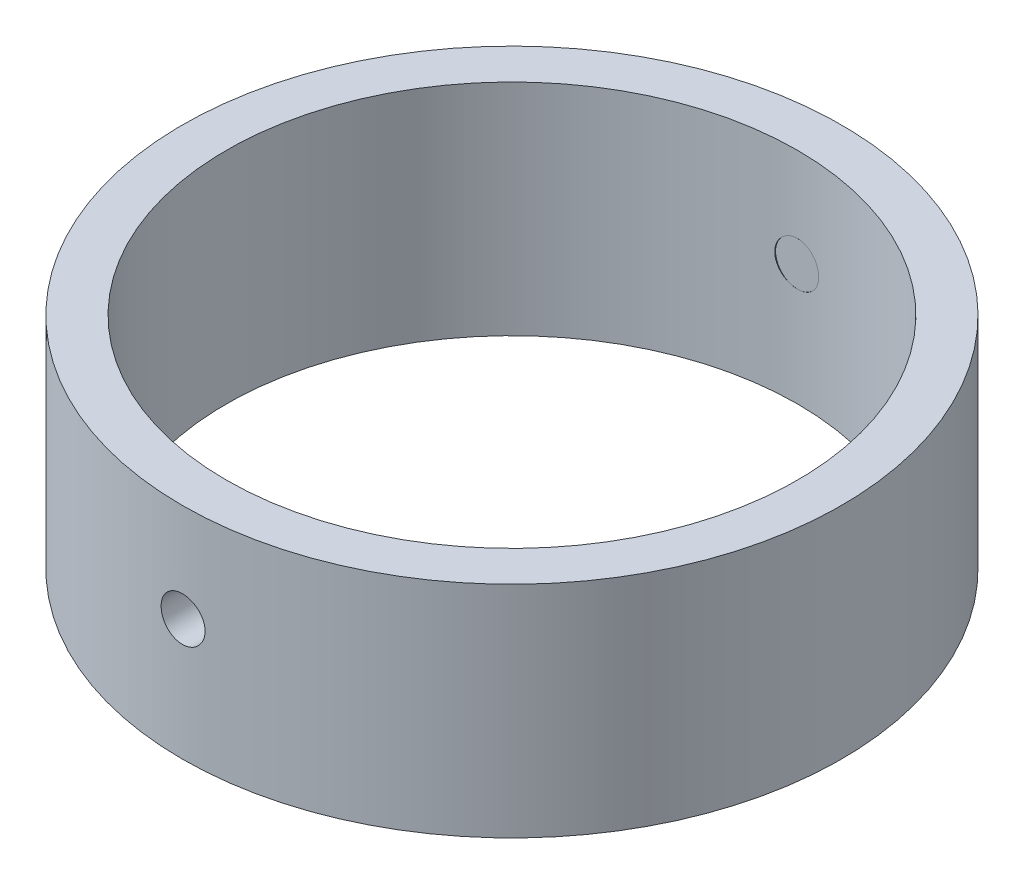
ISO-10303-21;
HEADER;
FILE_DESCRIPTION(('STEP AP214'),'2;1');
FILE_NAME('part.step','',(''),(''),'','','');
FILE_SCHEMA(('AUTOMOTIVE_DESIGN { 1 0 10303 214 1 1 1 1 }'));
ENDSEC;
DATA;
#1=APPLICATION_CONTEXT('core data for automotive mechanical design processes');
#2=APPLICATION_PROTOCOL_DEFINITION('international standard','automotive_design',2000,#1);
#3=PRODUCT_CONTEXT('',#1,'mechanical');
#4=PRODUCT('Part','Part','',(#3));
#5=PRODUCT_RELATED_PRODUCT_CATEGORY('part','',(#4));
#6=PRODUCT_DEFINITION_FORMATION('','',#4);
#7=PRODUCT_DEFINITION_CONTEXT('part definition',#1,'design');
#8=PRODUCT_DEFINITION('design','',#6,#7);
#9=PRODUCT_DEFINITION_SHAPE('','',#8);
#10=(LENGTH_UNIT() NAMED_UNIT(*) SI_UNIT(.MILLI.,.METRE.));
#11=(NAMED_UNIT(*) PLANE_ANGLE_UNIT() SI_UNIT($,.RADIAN.));
#12=(NAMED_UNIT(*) SI_UNIT($,.STERADIAN.) SOLID_ANGLE_UNIT());
#13=UNCERTAINTY_MEASURE_WITH_UNIT(LENGTH_MEASURE(1.E-05),#10,'distance_accuracy_value','');
#14=(GEOMETRIC_REPRESENTATION_CONTEXT(3) GLOBAL_UNCERTAINTY_ASSIGNED_CONTEXT((#13)) GLOBAL_UNIT_ASSIGNED_CONTEXT((#10,
#11,#12)) REPRESENTATION_CONTEXT('',''));
#15=CARTESIAN_POINT('',(0.,0.,0.));
#16=DIRECTION('',(0.,0.,1.));
#17=DIRECTION('',(1.,0.,0.));
#18=AXIS2_PLACEMENT_3D('',#15,#16,#17);
#19=CARTESIAN_POINT('',(0.,10.,0.));
#20=DIRECTION('',(0.,1.,0.));
#21=DIRECTION('',(0.,0.,1.));
#22=AXIS2_PLACEMENT_3D('',#19,#20,#21);
#23=PLANE('',#22);
#24=CARTESIAN_POINT('',(0.,10.,0.));
#25=DIRECTION('',(0.,1.,0.));
#26=DIRECTION('',(0.,0.,1.));
#27=AXIS2_PLACEMENT_3D('',#24,#25,#26);
#28=CIRCLE('',#27,15.);
#29=CARTESIAN_POINT('',(0.,10.,15.));
#30=VERTEX_POINT('',#29);
#31=EDGE_CURVE('E62',#30,#30,#28,.T.);
#32=ORIENTED_EDGE('',*,*,#31,.T.);
#33=EDGE_LOOP('',(#32));
#34=FACE_BOUND('',#33,.T.);
#35=CARTESIAN_POINT('',(0.,10.,0.));
#36=DIRECTION('',(0.,1.,0.));
#37=DIRECTION('',(0.,0.,1.));
#38=AXIS2_PLACEMENT_3D('',#35,#36,#37);
#39=CIRCLE('',#38,13.);
#40=CARTESIAN_POINT('',(0.,10.,13.));
#41=VERTEX_POINT('',#40);
#42=EDGE_CURVE('E77',#41,#41,#39,.T.);
#43=ORIENTED_EDGE('',*,*,#42,.F.);
#44=EDGE_LOOP('',(#43));
#45=FACE_BOUND('',#44,.T.);
#46=ADVANCED_FACE('F35',(#34,#45),#23,.T.);
#47=CARTESIAN_POINT('',(0.,0.,0.));
#48=DIRECTION('',(0.,1.,0.));
#49=DIRECTION('',(0.,0.,1.));
#50=AXIS2_PLACEMENT_3D('',#47,#48,#49);
#51=PLANE('',#50);
#52=CARTESIAN_POINT('',(0.,0.,0.));
#53=DIRECTION('',(0.,1.,0.));
#54=DIRECTION('',(0.,0.,1.));
#55=AXIS2_PLACEMENT_3D('',#52,#53,#54);
#56=CIRCLE('',#55,15.);
#57=CARTESIAN_POINT('',(0.,0.,15.));
#58=VERTEX_POINT('',#57);
#59=EDGE_CURVE('E84',#58,#58,#56,.T.);
#60=ORIENTED_EDGE('',*,*,#59,.F.);
#61=EDGE_LOOP('',(#60));
#62=FACE_BOUND('',#61,.T.);
#63=CARTESIAN_POINT('',(0.,0.,0.));
#64=DIRECTION('',(0.,1.,0.));
#65=DIRECTION('',(0.,0.,1.));
#66=AXIS2_PLACEMENT_3D('',#63,#64,#65);
#67=CIRCLE('',#66,13.);
#68=CARTESIAN_POINT('',(0.,0.,13.));
#69=VERTEX_POINT('',#68);
#70=EDGE_CURVE('E80',#69,#69,#67,.T.);
#71=ORIENTED_EDGE('',*,*,#70,.T.);
#72=EDGE_LOOP('',(#71));
#73=FACE_BOUND('',#72,.T.);
#74=ADVANCED_FACE('F109',(#62,#73),#51,.F.);
#75=CARTESIAN_POINT('',(0.,10.,0.));
#76=DIRECTION('',(0.,-1.,0.));
#77=DIRECTION('',(0.,0.,-1.));
#78=AXIS2_PLACEMENT_3D('',#75,#76,#77);
#79=CYLINDRICAL_SURFACE('',#78,15.);
#80=CARTESIAN_POINT('',(1.04744440165295E-13,4.52304622119221,15.0000000000001));
#81=CARTESIAN_POINT('',(-0.0561035908040197,4.52304868674044,14.9999995579848));
#82=CARTESIAN_POINT('',(-0.112246272047639,4.52778350882153,14.9996818744052));
#83=CARTESIAN_POINT('',(-0.222980853460822,4.54660338092677,14.99844511371));
#84=CARTESIAN_POINT('',(-0.277570880681974,4.56069926249249,14.9975253399424));
#85=CARTESIAN_POINT('',(-0.38358016735959,4.59783409631329,14.9951884301052));
#86=CARTESIAN_POINT('',(-0.435001104032067,4.62086827012138,14.9937715598241));
#87=CARTESIAN_POINT('',(-0.533233465282883,4.67521793836342,14.9905997328555));
#88=CARTESIAN_POINT('',(-0.580045929848426,4.70653155848063,14.9888448527116));
#89=CARTESIAN_POINT('',(-0.667824599458738,4.7766088217749,14.9851908975273));
#90=CARTESIAN_POINT('',(-0.708782006678481,4.81538347503575,14.9832916119278));
#91=CARTESIAN_POINT('',(-0.783612634377412,4.89925929298686,14.9795646978327));
#92=CARTESIAN_POINT('',(-0.817485556225998,4.94436072423444,14.9777370723604));
#93=CARTESIAN_POINT('',(-0.877213460326592,5.03966051252165,14.9743579336721));
#94=CARTESIAN_POINT('',(-0.903061029326273,5.08986352557153,14.9728066763058));
#95=CARTESIAN_POINT('',(-0.945957097391494,5.19390879568899,14.970157972686));
#96=CARTESIAN_POINT('',(-0.963005701794614,5.24775100918082,14.9690605209997));
#97=CARTESIAN_POINT('',(-0.987795199392783,5.35746066580199,14.9674452176353));
#98=CARTESIAN_POINT('',(-0.995550016427454,5.41332494979255,14.9669264989871));
#99=CARTESIAN_POINT('',(-1.00157479750793,5.52556451891834,14.9665245630443));
#100=CARTESIAN_POINT('',(-0.99984488145748,5.58193979758471,14.9666413377159));
#101=CARTESIAN_POINT('',(-0.986960846772642,5.69350609720749,14.9674964150486));
#102=CARTESIAN_POINT('',(-0.975821806744484,5.74869886817153,14.9682337232656));
#103=CARTESIAN_POINT('',(-0.944459115591247,5.85642951162068,14.9702452157825));
#104=CARTESIAN_POINT('',(-0.924235403921985,5.9089673664097,14.9715194036602));
#105=CARTESIAN_POINT('',(-0.875260370110659,6.00994519565261,14.9744622124897));
#106=CARTESIAN_POINT('',(-0.846502221174277,6.05838184948964,14.9761311489876));
#107=CARTESIAN_POINT('',(-0.781279592923117,6.14974603370342,14.9796750723207));
#108=CARTESIAN_POINT('',(-0.744815014647346,6.19267349332327,14.9815500618019));
#109=CARTESIAN_POINT('',(-0.665129760832686,6.27188845591977,14.985299217381));
#110=CARTESIAN_POINT('',(-0.621896038198208,6.30816283605418,14.9871733747298));
#111=CARTESIAN_POINT('',(-0.529945441656749,6.37294067824538,14.990706156798));
#112=CARTESIAN_POINT('',(-0.481228565576676,6.40144413722237,14.9923647814319));
#113=CARTESIAN_POINT('',(-0.379686494733726,6.44986996992648,14.9952797619227));
#114=CARTESIAN_POINT('',(-0.326861055090694,6.46979183170658,14.9965360937791));
#115=CARTESIAN_POINT('',(-0.218604996080197,6.5004801207606,14.9985046094346));
#116=CARTESIAN_POINT('',(-0.163174411331601,6.51124666966,14.9992168004624));
#117=CARTESIAN_POINT('',(-0.0513953711244985,6.52330241544879,15.0000158534359));
#118=CARTESIAN_POINT('',(0.00495111964694698,6.52460975277294,15.0001039123065));
#119=CARTESIAN_POINT('',(0.117062571675702,6.51775738492027,14.9996479643198));
#120=CARTESIAN_POINT('',(0.172827536380592,6.50959773590076,14.9991039612117));
#121=CARTESIAN_POINT('',(0.282141760529473,6.48405804083742,14.9974458893639));
#122=CARTESIAN_POINT('',(0.33569297650906,6.4666863328146,14.9963323361678));
#123=CARTESIAN_POINT('',(0.439120008014296,6.42322411550642,14.9936604087425));
#124=CARTESIAN_POINT('',(0.488995785972957,6.39713351711956,14.9921020299676));
#125=CARTESIAN_POINT('',(0.583739131383387,6.33692806133133,14.9887124988692));
#126=CARTESIAN_POINT('',(0.6285989960136,6.30280110566536,14.9868809368236));
#127=CARTESIAN_POINT('',(0.711959527646589,6.22750926028824,14.9831524773505));
#128=CARTESIAN_POINT('',(0.750460123620553,6.18634429197762,14.9812555791934));
#129=CARTESIAN_POINT('',(0.820070815484597,6.09806659773214,14.9776067587531));
#130=CARTESIAN_POINT('',(0.851169130356722,6.05094457097495,14.9758550704263));
#131=CARTESIAN_POINT('',(0.905011874107482,5.95213704562234,14.9726979544392));
#132=CARTESIAN_POINT('',(0.92775636023732,5.90045157830452,14.971292524406));
#133=CARTESIAN_POINT('',(0.964225471727997,5.79402712989296,14.9689881146233));
#134=CARTESIAN_POINT('',(0.977957475914941,5.73929068667697,14.9680887206512));
#135=CARTESIAN_POINT('',(0.996035908200127,5.62828288963722,14.9668966664299));
#136=CARTESIAN_POINT('',(1.00038244478051,5.57201155356215,14.9666039991678));
#137=CARTESIAN_POINT('',(0.999565483534892,5.45964843155606,14.9666585741728));
#138=CARTESIAN_POINT('',(0.994420504639195,5.40355650943576,14.9670045703421));
#139=CARTESIAN_POINT('',(0.974804994261913,5.29303495372458,14.9682948425397));
#140=CARTESIAN_POINT('',(0.960334446280312,5.23860532307501,14.9692391196265));
#141=CARTESIAN_POINT('',(0.922482837782944,5.13295092692824,14.9716192360536));
#142=CARTESIAN_POINT('',(0.899101904669283,5.08172611562021,14.9730550683655));
#143=CARTESIAN_POINT('',(0.844095647375377,4.98392647927371,14.9762564813155));
#144=CARTESIAN_POINT('',(0.812470521740393,4.93735154228946,14.9780220540122));
#145=CARTESIAN_POINT('',(0.741804774943735,4.85007958219265,14.9816880295888));
#146=CARTESIAN_POINT('',(0.702750674583105,4.80939348386031,14.9835886735546));
#147=CARTESIAN_POINT('',(0.618355426554815,4.735140211925,14.9873085213531));
#148=CARTESIAN_POINT('',(0.573012746113411,4.70157477896845,14.9891277051874));
#149=CARTESIAN_POINT('',(0.477269598838999,4.64248740364637,14.9924817745562));
#150=CARTESIAN_POINT('',(0.42686240797062,4.61697634599836,14.994016274223));
#151=CARTESIAN_POINT('',(0.322506215419461,4.57481119196057,14.9966230436255));
#152=CARTESIAN_POINT('',(0.268561431383555,4.55814675648863,14.997695852662));
#153=CARTESIAN_POINT('',(0.178573873772219,4.538463731604,14.9989782377769));
#154=CARTESIAN_POINT('',(0.143112284162083,4.5326896778747,14.9993596884566));
#155=CARTESIAN_POINT('',(0.0717724628197615,4.5249801370196,14.9998707107647));
#156=CARTESIAN_POINT('',(0.0358942317521772,4.52304464377161,15.0000002827949));
#157=CARTESIAN_POINT('',(1.04744440165295E-13,4.52304622119221,15.0000000000001));
#158=B_SPLINE_CURVE_WITH_KNOTS('',3,(#80,#81,#82,#83,#84,#85,#86,#87,#88,#89,#90,#91,#92,#93,
#94,#95,#96,#97,#98,#99,#100,#101,#102,#103,#104,#105,#106,#107,#108,#109,#110,#111,#112,#113,
#114,#115,#116,#117,#118,#119,#120,#121,#122,#123,#124,#125,#126,#127,#128,#129,#130,#131,#132,
#133,#134,#135,#136,#137,#138,#139,#140,#141,#142,#143,#144,#145,#146,#147,#148,#149,#150,#151,
#152,#153,#154,#155,#156,#157),.UNSPECIFIED.,.T.,.F.,(4,2,2,2,2,2,2,2,2,2,2,2,2,2,2,2,2,2,2,2,2,
2,2,2,2,2,2,2,2,2,2,2,2,2,2,2,2,2,4),(0.,0.168179734044291,0.336554406184461,0.504839188283246,
0.673085906323962,0.841582833287235,1.01008686142994,1.17874608173165,1.34740328286781,
1.51580748668391,1.68420956157893,1.85234227434813,2.02047610764314,2.18874479730908,
2.35701564790423,2.52561491574574,2.69421425040695,2.86282364170141,3.0314307930374,
3.19971451152963,3.36799723178316,3.53612789526983,3.70426027699717,3.87264740882398,
4.04103642129616,4.20969166582445,4.37834575448806,4.54686158747342,4.71537547265432,
4.88356091745659,5.05174665983533,5.21992999755775,5.3881092852874,5.55659668097782,
5.72512521606818,5.89388053603615,6.06243819437153,6.17003722486686,6.27763608375031),.UNSPECIFIED.);
#159=CARTESIAN_POINT('',(1.04744440165295E-13,4.52304622119221,15.0000000000001));
#160=VERTEX_POINT('',#159);
#161=EDGE_CURVE('E82',#160,#160,#158,.T.);
#162=ORIENTED_EDGE('',*,*,#161,.T.);
#163=EDGE_LOOP('',(#162));
#164=FACE_BOUND('',#163,.T.);
#165=ORIENTED_EDGE('',*,*,#31,.F.);
#166=EDGE_LOOP('',(#165));
#167=FACE_BOUND('',#166,.T.);
#168=ORIENTED_EDGE('',*,*,#59,.T.);
#169=EDGE_LOOP('',(#168));
#170=FACE_BOUND('',#169,.T.);
#171=ADVANCED_FACE('F37',(#164,#167,#170),#79,.T.);
#172=CARTESIAN_POINT('',(0.,10.,0.));
#173=DIRECTION('',(0.,-1.,0.));
#174=DIRECTION('',(0.,0.,-1.));
#175=AXIS2_PLACEMENT_3D('',#172,#173,#174);
#176=CYLINDRICAL_SURFACE('',#175,13.);
#177=CARTESIAN_POINT('',(-0.99999999999991,5.52304622119221,12.9614813968157));
#178=CARTESIAN_POINT('',(-0.999997543832567,5.5791274351691,12.9614819088694));
#179=CARTESIAN_POINT('',(-0.995266480847394,5.63524719684244,12.9618492886988));
#180=CARTESIAN_POINT('',(-0.97646241778345,5.74593502756544,12.963279161761));
#181=CARTESIAN_POINT('',(-0.962378734981717,5.80050124771975,12.9643424498521));
#182=CARTESIAN_POINT('',(-0.925278213259011,5.90646277686901,12.9670429980549));
#183=CARTESIAN_POINT('',(-0.902266320734499,5.95785982340505,12.9686799403029));
#184=CARTESIAN_POINT('',(-0.847971142516425,6.05604914194624,12.9723429544135));
#185=CARTESIAN_POINT('',(-0.816689667547051,6.10284241892794,12.9743689410636));
#186=CARTESIAN_POINT('',(-0.746668422254026,6.19061183718649,12.9785867956826));
#187=CARTESIAN_POINT('',(-0.707914192285015,6.23157642856032,12.9807789801682));
#188=CARTESIAN_POINT('',(-0.624077941066679,6.30642651941768,12.9850793141232));
#189=CARTESIAN_POINT('',(-0.578995647782891,6.34031171441211,12.9871874599748));
#190=CARTESIAN_POINT('',(-0.48371507546163,6.40007879006431,12.9910851137279));
#191=CARTESIAN_POINT('',(-0.433510582984074,6.42595079318073,12.992874227228));
#192=CARTESIAN_POINT('',(-0.329454148660404,6.46889388200011,12.9959288390731));
#193=CARTESIAN_POINT('',(-0.275602262271294,6.4859651014811,12.9971943453772));
#194=CARTESIAN_POINT('',(-0.165893712313264,6.51078910478538,12.9990569482759));
#195=CARTESIAN_POINT('',(-0.110041265268459,6.51856042203651,12.9996553741065));
#196=CARTESIAN_POINT('',(0.00217826805055607,6.52462129572696,13.0001208859667));
#197=CARTESIAN_POINT('',(0.0585453460124394,6.52291100504382,12.999987983788));
#198=CARTESIAN_POINT('',(0.170068466214814,6.51007241034428,12.9990069147535));
#199=CARTESIAN_POINT('',(0.225226818127711,6.49896403767474,12.9981602616262));
#200=CARTESIAN_POINT('',(0.332893745005603,6.46767557596302,12.9958486911578));
#201=CARTESIAN_POINT('',(0.385402297939032,6.44749541150789,12.9943837686772));
#202=CARTESIAN_POINT('',(0.48634271851216,6.39861387243026,12.9909979032432));
#203=CARTESIAN_POINT('',(0.534770229354281,6.36990353555269,12.9890764810944));
#204=CARTESIAN_POINT('',(0.626126327174962,6.30478314268146,12.9849936502234));
#205=CARTESIAN_POINT('',(0.669054819362128,6.26837295398739,12.9828322373655));
#206=CARTESIAN_POINT('',(0.748310764737765,6.18877399540823,12.9785058412248));
#207=CARTESIAN_POINT('',(0.784620833082264,6.145567913063,12.9763408631938));
#208=CARTESIAN_POINT('',(0.849475002612157,6.05366406977903,12.9722569949332));
#209=CARTESIAN_POINT('',(0.878019098683904,6.00496630522422,12.9703381048656));
#210=CARTESIAN_POINT('',(0.926530205587165,5.90344963125691,12.9669632545483));
#211=CARTESIAN_POINT('',(0.946496371717227,5.85063031658454,12.9655073398933));
#212=CARTESIAN_POINT('',(0.977272276209372,5.74237545463727,12.9632241021591));
#213=CARTESIAN_POINT('',(0.988082178272288,5.68693995415472,12.9623967678419));
#214=CARTESIAN_POINT('',(1.00021681140709,5.57517829273446,12.961466121858));
#215=CARTESIAN_POINT('',(1.00156575966864,5.5188547759364,12.9613609616577));
#216=CARTESIAN_POINT('',(0.9948035752051,5.40678236861051,12.9618816882153));
#217=CARTESIAN_POINT('',(0.986692517486987,5.35103347353012,12.962507569177));
#218=CARTESIAN_POINT('',(0.961260728797856,5.24176198590073,12.9644181674954));
#219=CARTESIAN_POINT('',(0.943951249266599,5.18823675943172,12.9657020798851));
#220=CARTESIAN_POINT('',(0.900625392877042,5.08485050104135,12.9687833982427));
#221=CARTESIAN_POINT('',(0.8746088966995,5.03498951934551,12.9705808112474));
#222=CARTESIAN_POINT('',(0.814546034968147,4.94023615740742,12.974491083173));
#223=CARTESIAN_POINT('',(0.78048350144627,4.89535405228778,12.9766045740523));
#224=CARTESIAN_POINT('',(0.705318886381825,4.81193621489396,12.9809066946844));
#225=CARTESIAN_POINT('',(0.664216701432581,4.77340057586044,12.9830953255405));
#226=CARTESIAN_POINT('',(0.57603501480018,4.70368718390987,12.9873065903578));
#227=CARTESIAN_POINT('',(0.528943071294105,4.67252514412228,12.9893288639387));
#228=CARTESIAN_POINT('',(0.430180817109752,4.6185512394482,12.9929743705287));
#229=CARTESIAN_POINT('',(0.378510546335186,4.59573930179292,12.9945976070153));
#230=CARTESIAN_POINT('',(0.272115164371706,4.55914025241307,12.9972604680251));
#231=CARTESIAN_POINT('',(0.217393438542586,4.54534334718219,12.9983007256935));
#232=CARTESIAN_POINT('',(0.106401852455714,4.52713398340076,12.9996829770807));
#233=CARTESIAN_POINT('',(0.0501320167520726,4.52272137609546,13.0000249818678));
#234=CARTESIAN_POINT('',(-0.0622034047511974,4.52340749104947,12.9999722162381));
#235=CARTESIAN_POINT('',(-0.118269142852628,4.52848169151278,12.9995793453495));
#236=CARTESIAN_POINT('',(-0.228749776186422,4.5479463454896,12.9981047413143));
#237=CARTESIAN_POINT('',(-0.2831646689213,4.56233681309651,12.9970230071256));
#238=CARTESIAN_POINT('',(-0.388801217973268,4.60001948883523,12.994292116328));
#239=CARTESIAN_POINT('',(-0.44002299507762,4.62331136001214,12.9926429811979));
#240=CARTESIAN_POINT('',(-0.537832884810738,4.67813272864393,12.988962009249));
#241=CARTESIAN_POINT('',(-0.58442108644389,4.70966206782657,12.9869301797835));
#242=CARTESIAN_POINT('',(-0.6717666382085,4.78015519966456,12.9827057905095));
#243=CARTESIAN_POINT('',(-0.712509395058678,4.81913705117515,12.9805128484099));
#244=CARTESIAN_POINT('',(-0.786888987834143,4.9033978785432,12.9762166160593));
#245=CARTESIAN_POINT('',(-0.82052409457307,4.94867838233684,12.9741133477237));
#246=CARTESIAN_POINT('',(-0.879772037884943,5.04432665869697,12.9702307965036));
#247=CARTESIAN_POINT('',(-0.905371496116408,5.09470273234878,12.9684520559567));
#248=CARTESIAN_POINT('',(-0.947716409088723,5.19901664584257,12.9654266595715));
#249=CARTESIAN_POINT('',(-0.964472107814933,5.25295028299212,12.9641793884409));
#250=CARTESIAN_POINT('',(-0.984356700774499,5.34317952909333,12.962680999785));
#251=CARTESIAN_POINT('',(-0.990215212256077,5.37889378430111,12.9622331969784));
#252=CARTESIAN_POINT('',(-0.998037649303361,5.45074875972335,12.961633230757));
#253=CARTESIAN_POINT('',(-1.00000158354283,5.48688947898783,12.9614810666839));
#254=CARTESIAN_POINT('',(-0.99999999999991,5.52304622119221,12.9614813968157));
#255=B_SPLINE_CURVE_WITH_KNOTS('',3,(#177,#178,#179,#180,#181,#182,#183,#184,#185,#186,#187,
#188,#189,#190,#191,#192,#193,#194,#195,#196,#197,#198,#199,#200,#201,#202,#203,#204,#205,#206,
#207,#208,#209,#210,#211,#212,#213,#214,#215,#216,#217,#218,#219,#220,#221,#222,#223,#224,#225,
#226,#227,#228,#229,#230,#231,#232,#233,#234,#235,#236,#237,#238,#239,#240,#241,#242,#243,#244,
#245,#246,#247,#248,#249,#250,#251,#252,#253,#254),.UNSPECIFIED.,.T.,.F.,(4,2,2,2,2,2,2,2,2,2,2,
2,2,2,2,2,2,2,2,2,2,2,2,2,2,2,2,2,2,2,2,2,2,2,2,2,2,2,4),(0.,0.168111633970558,
0.336415618974141,0.504626493239299,0.672800566180434,0.841303379007266,1.00981343775061,
1.17853039294234,1.34724478344336,1.51562238641992,1.68399727455317,1.85201596765536,
2.02003605750701,2.18823330628603,2.35643345403812,2.52506924471712,2.69370514643721,
2.86235765057303,3.03100713938096,3.19922477826631,3.36744108338817,3.53545209962578,
3.70346541834756,3.87181926439556,4.04017558363494,4.20888750240394,4.37759795086084,
4.54612481416911,4.71464900606211,4.88273819351536,5.05082763525016,5.21891071473531,
5.3869905649601,5.55548298887882,5.72401635744393,5.89282884261519,6.06144535581385,
6.16983071549863,6.27821583379392),.UNSPECIFIED.);
#256=CARTESIAN_POINT('',(-0.99999999999991,5.52304622119221,12.9614813968157));
#257=VERTEX_POINT('',#256);
#258=EDGE_CURVE('E40',#257,#257,#255,.T.);
#259=ORIENTED_EDGE('',*,*,#258,.F.);
#260=EDGE_LOOP('',(#259));
#261=FACE_BOUND('',#260,.T.);
#262=CARTESIAN_POINT('',(0.,6.52304622119221,-13.));
#263=CARTESIAN_POINT('',(-0.0560814907698499,6.52304376527476,-12.9999994935529));
#264=CARTESIAN_POINT('',(-0.112201528326102,6.51831265716772,-12.9996332271085));
#265=CARTESIAN_POINT('',(-0.222889932281071,6.49950839857557,-12.9982073319335));
#266=CARTESIAN_POINT('',(-0.277456450000713,6.48542456631394,-12.997146910426));
#267=CARTESIAN_POINT('',(-0.383418608244882,6.44832360733937,-12.994452581674));
#268=CARTESIAN_POINT('',(-0.434815983790371,6.42531141990358,-12.9928189915613));
#269=CARTESIAN_POINT('',(-0.533005853178264,6.37101554727529,-12.9891617044986));
#270=CARTESIAN_POINT('',(-0.579799352410943,6.33973367353528,-12.9871380930081));
#271=CARTESIAN_POINT('',(-0.667568517957933,6.2697120261558,-12.9829230046582));
#272=CARTESIAN_POINT('',(-0.708532705181952,6.23095788188994,-12.9807312093192));
#273=CARTESIAN_POINT('',(-0.783382016525595,6.14712197153286,-12.9764294687494));
#274=CARTESIAN_POINT('',(-0.817266834917272,6.10203993230716,-12.9743195270567));
#275=CARTESIAN_POINT('',(-0.877033518122117,6.00675958084738,-12.9704168624999));
#276=CARTESIAN_POINT('',(-0.902905435846645,5.95655501149874,-12.968624535088));
#277=CARTESIAN_POINT('',(-0.945848345563006,5.85249841005016,-12.9655635081004));
#278=CARTESIAN_POINT('',(-0.962919472356694,5.79864643383192,-12.9642948005044));
#279=CARTESIAN_POINT('',(-0.987743279956243,5.68893761592277,-12.9624272217792));
#280=CARTESIAN_POINT('',(-0.995514486774788,5.63308498914811,-12.9618270191131));
#281=CARTESIAN_POINT('',(-1.00157507733578,5.52086510444521,-12.9613601552788));
#282=CARTESIAN_POINT('',(-0.999864615135394,5.46449785489336,-12.9614934821925));
#283=CARTESIAN_POINT('',(-0.987025750384255,5.35297549513603,-12.9624774073116));
#284=CARTESIAN_POINT('',(-0.975917451791262,5.2978180550961,-12.9633264743837));
#285=CARTESIAN_POINT('',(-0.944629454899793,5.19015291377075,-12.9656438018103));
#286=CARTESIAN_POINT('',(-0.924449679526577,5.13764523500294,-12.9671120674258));
#287=CARTESIAN_POINT('',(-0.87556894297026,5.03670586826641,-12.97050410972));
#288=CARTESIAN_POINT('',(-0.846858928239544,4.98827858146169,-12.9724283699259));
#289=CARTESIAN_POINT('',(-0.781739221271343,4.89692279479538,-12.9765151166631));
#290=CARTESIAN_POINT('',(-0.74532939651674,4.85399438959239,-12.978677607294));
#291=CARTESIAN_POINT('',(-0.665730694226137,4.77473802752221,-12.9830039524831));
#292=CARTESIAN_POINT('',(-0.622524430401528,4.73842752914293,-12.9851677959587));
#293=CARTESIAN_POINT('',(-0.530620071475165,4.67357257870465,-12.9892476500003));
#294=CARTESIAN_POINT('',(-0.481921973376384,4.6450281308838,-12.991163660431));
#295=CARTESIAN_POINT('',(-0.380405213011671,4.59651677163731,-12.9945322475704));
#296=CARTESIAN_POINT('',(-0.327586197932186,4.57655059559729,-12.9959847845445));
#297=CARTESIAN_POINT('',(-0.219331986593682,4.54577457930395,-12.9982622809101));
#298=CARTESIAN_POINT('',(-0.163896836613613,4.53496457714365,-12.9990872513988));
#299=CARTESIAN_POINT('',(-0.0521353319360836,4.5228295670569,-13.0000152355339));
#300=CARTESIAN_POINT('',(0.00418838895961627,4.52148043656107,-13.0001200852723));
#301=CARTESIAN_POINT('',(0.116261248401114,4.52824232942064,-12.9996009110167));
#302=CARTESIAN_POINT('',(0.172010391499502,4.53635327776213,-12.9989768928024));
#303=CARTESIAN_POINT('',(0.281283080874896,4.56178510143632,-12.9970713651132));
#304=CARTESIAN_POINT('',(0.334809235536055,4.57909483397392,-12.9957906511816));
#305=CARTESIAN_POINT('',(0.438197238207585,4.62242150763473,-12.9927156735826));
#306=CARTESIAN_POINT('',(0.488059036617916,4.64843856659222,-12.9909214029654));
#307=CARTESIAN_POINT('',(0.582812945329919,4.70850225116987,-12.987016029033));
#308=CARTESIAN_POINT('',(0.6276948712759,4.74256490165887,-12.9849042965023));
#309=CARTESIAN_POINT('',(0.711112292589968,4.81772964801486,-12.9806035048102));
#310=CARTESIAN_POINT('',(0.749647693943421,4.85883184814427,-12.9784144445039));
#311=CARTESIAN_POINT('',(0.819360586100501,4.947013429021,-12.974200318524));
#312=CARTESIAN_POINT('',(0.850522366332108,4.99410524929113,-12.9721756089433));
#313=CARTESIAN_POINT('',(0.904495815325659,5.09286718910452,-12.9685242888167));
#314=CARTESIAN_POINT('',(0.927307556812929,5.14453726876819,-12.9668976748036));
#315=CARTESIAN_POINT('',(0.963906473396946,5.25093278258004,-12.9642285924288));
#316=CARTESIAN_POINT('',(0.97770335706161,5.30565486068436,-12.9631854958217));
#317=CARTESIAN_POINT('',(0.995912558294069,5.41664718860939,-12.9617993686693));
#318=CARTESIAN_POINT('',(1.00032502648944,5.47291741356639,-12.9614563268874));
#319=CARTESIAN_POINT('',(0.99963851157942,5.58525258527132,-12.9615092798327));
#320=CARTESIAN_POINT('',(0.994564216946108,5.6413176854614,-12.9619033562753));
#321=CARTESIAN_POINT('',(0.975099599309244,5.75179701980225,-12.9633820704167));
#322=CARTESIAN_POINT('',(0.960709261076485,5.80621125125416,-12.9644667092444));
#323=CARTESIAN_POINT('',(0.923027087120128,5.91184649565123,-12.967203837997));
#324=CARTESIAN_POINT('',(0.899735591367252,5.96306763046659,-12.968856306234));
#325=CARTESIAN_POINT('',(0.844915171953808,6.06087639270206,-12.9725429181572));
#326=CARTESIAN_POINT('',(0.81338640586191,6.10746410873012,-12.9745770545423));
#327=CARTESIAN_POINT('',(0.742893897823788,6.19480970439268,-12.9788040663569));
#328=CARTESIAN_POINT('',(0.703911966411862,6.23555288559401,-12.9809973218178));
#329=CARTESIAN_POINT('',(0.619650805552183,6.30993329714912,-12.9852920085213));
#330=CARTESIAN_POINT('',(0.574370049103556,6.34356879941867,-12.9873934173351));
#331=CARTESIAN_POINT('',(0.478721573484138,6.40281716093632,-12.9912708677167));
#332=CARTESIAN_POINT('',(0.428345598441358,6.42841671487166,-12.9930463676726));
#333=CARTESIAN_POINT('',(0.324031895419079,6.47076183421947,-12.9960653549984));
#334=CARTESIAN_POINT('',(0.270098369537908,6.48751764221658,-12.9973094574984));
#335=CARTESIAN_POINT('',(0.179868830247523,6.50740254799958,-12.9988038385362));
#336=CARTESIAN_POINT('',(0.144154148453303,6.51326120018031,-12.9992503735318));
#337=CARTESIAN_POINT('',(0.0722983180735118,6.52108382418015,-12.9998486171984));
#338=CARTESIAN_POINT('',(0.0361571704282503,6.52304780458495,-13.0000003265194));
#339=CARTESIAN_POINT('',(0.,6.52304622119221,-13.));
#340=B_SPLINE_CURVE_WITH_KNOTS('',3,(#262,#263,#264,#265,#266,#267,#268,#269,#270,#271,#272,
#273,#274,#275,#276,#277,#278,#279,#280,#281,#282,#283,#284,#285,#286,#287,#288,#289,#290,#291,
#292,#293,#294,#295,#296,#297,#298,#299,#300,#301,#302,#303,#304,#305,#306,#307,#308,#309,#310,
#311,#312,#313,#314,#315,#316,#317,#318,#319,#320,#321,#322,#323,#324,#325,#326,#327,#328,#329,
#330,#331,#332,#333,#334,#335,#336,#337,#338,#339),.UNSPECIFIED.,.T.,.F.,(4,2,2,2,2,2,2,2,2,2,2,
2,2,2,2,2,2,2,2,2,2,2,2,2,2,2,2,2,2,2,2,2,2,2,2,2,2,2,4),(0.,0.168112465315286,
0.336417263394327,0.504629085620899,0.672804091988174,0.841305817090079,1.00981481756412,
1.17853217168541,1.34724694148354,1.51562505862669,1.68400043998793,1.85201653894625,
2.02003406546067,2.18823055785305,2.35642994521671,2.52506682664289,2.69370380009873,
2.86235522733704,3.03100367227987,3.19922195412499,3.36743890208862,3.53545254615546,
3.70346846400482,3.87182189353087,4.04017781674659,4.20888928027391,4.37759927436034,
4.54612727511618,4.71465257083876,4.88273990456448,5.05082751306817,5.21890870227693,
5.38698667653834,5.55548020584205,5.7240146538275,5.89282669420573,6.06144278967872,
6.16982943161644,6.27821583461816),.UNSPECIFIED.);
#341=CARTESIAN_POINT('',(0.,6.52304622119221,-13.));
#342=VERTEX_POINT('',#341);
#343=CARTESIAN_POINT('',(0.,4.52304622119221,-13.));
#344=VERTEX_POINT('',#343);
#345=EDGE_CURVE('E11',#342,#344,#340,.T.);
#346=ORIENTED_EDGE('',*,*,#345,.F.);
#347=EDGE_CURVE('E49',#344,#342,#340,.T.);
#348=ORIENTED_EDGE('',*,*,#347,.F.);
#349=EDGE_LOOP('',(#346,#348));
#350=FACE_BOUND('',#349,.T.);
#351=ORIENTED_EDGE('',*,*,#42,.T.);
#352=EDGE_LOOP('',(#351));
#353=FACE_BOUND('',#352,.T.);
#354=ORIENTED_EDGE('',*,*,#70,.F.);
#355=EDGE_LOOP('',(#354));
#356=FACE_BOUND('',#355,.T.);
#357=ADVANCED_FACE('F69',(#261,#350,#353,#356),#176,.F.);
#358=CARTESIAN_POINT('',(1.04449972486434E-13,5.52304622119221,15.0000000000001));
#359=DIRECTION('',(0.,0.,-1.));
#360=DIRECTION('',(-1.,0.,0.));
#361=AXIS2_PLACEMENT_3D('',#358,#359,#360);
#362=CYLINDRICAL_SURFACE('',#361,1.);
#363=ORIENTED_EDGE('',*,*,#258,.T.);
#364=EDGE_LOOP('',(#363));
#365=FACE_BOUND('',#364,.T.);
#366=ORIENTED_EDGE('',*,*,#161,.F.);
#367=EDGE_LOOP('',(#366));
#368=FACE_BOUND('',#367,.T.);
#369=ADVANCED_FACE('F72',(#365,#368),#362,.F.);
#370=ORIENTED_EDGE('',*,*,#345,.T.);
#371=CARTESIAN_POINT('',(0.,5.52304622119221,-13.));
#372=DIRECTION('',(0.,0.,-1.));
#373=DIRECTION('',(-1.,0.,0.));
#374=AXIS2_PLACEMENT_3D('',#371,#372,#373);
#375=CIRCLE('',#374,1.);
#376=EDGE_CURVE('E64',#344,#342,#375,.T.);
#377=ORIENTED_EDGE('',*,*,#376,.T.);
#378=EDGE_LOOP('',(#370,#377));
#379=FACE_BOUND('',#378,.T.);
#380=ADVANCED_FACE('F65',(#379),#362,.F.);
#381=ORIENTED_EDGE('',*,*,#347,.T.);
#382=EDGE_CURVE('E55',#342,#344,#375,.T.);
#383=ORIENTED_EDGE('',*,*,#382,.T.);
#384=EDGE_LOOP('',(#381,#383));
#385=FACE_BOUND('',#384,.T.);
#386=ADVANCED_FACE('F59',(#385),#362,.F.);
#387=CARTESIAN_POINT('',(0.,5.52304622119221,-13.));
#388=DIRECTION('',(0.,0.,-1.));
#389=DIRECTION('',(-1.,0.,0.));
#390=AXIS2_PLACEMENT_3D('',#387,#388,#389);
#391=PLANE('',#390);
#392=ORIENTED_EDGE('',*,*,#376,.F.);
#393=ORIENTED_EDGE('',*,*,#382,.F.);
#394=EDGE_LOOP('',(#392,#393));
#395=FACE_BOUND('',#394,.T.);
#396=ADVANCED_FACE('F68',(#395),#391,.F.);
#397=CLOSED_SHELL('',(#46,#74,#171,#357,#369,#380,#386,#396));
#398=MANIFOLD_SOLID_BREP('B2',#397);
#399=ADVANCED_BREP_SHAPE_REPRESENTATION('',(#18,#398),#14);
#400=SHAPE_DEFINITION_REPRESENTATION(#9,#399);
ENDSEC;
END-ISO-10303-21;
